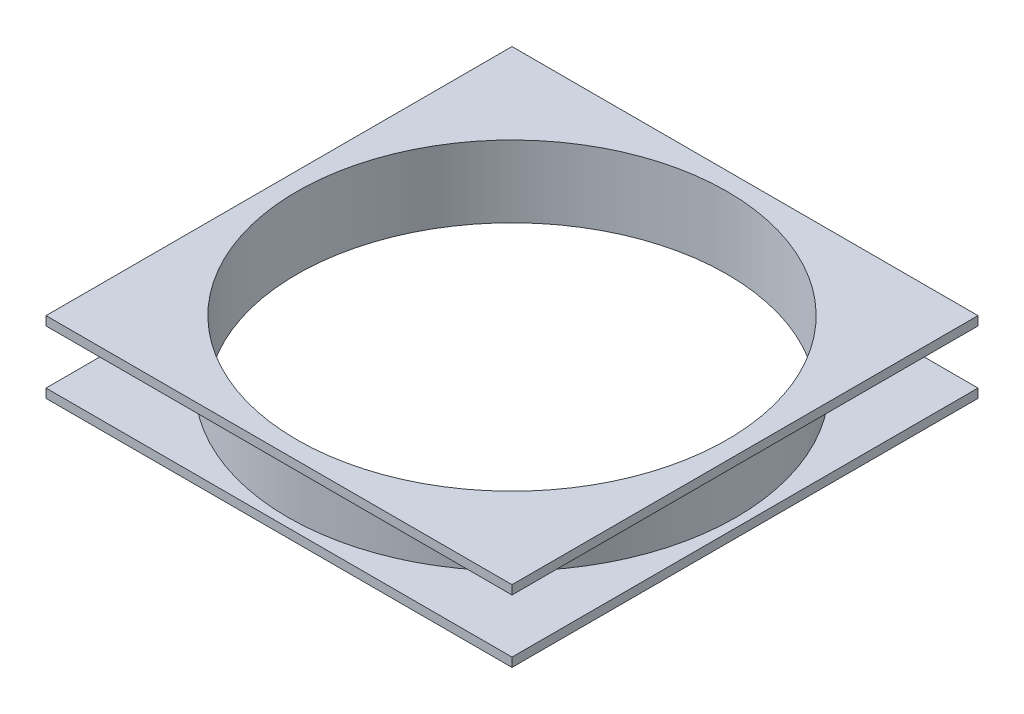
ISO-10303-21;
HEADER;
FILE_DESCRIPTION(('STEP AP214'),'2;1');
FILE_NAME('part.step','',(''),(''),'','','');
FILE_SCHEMA(('AUTOMOTIVE_DESIGN { 1 0 10303 214 1 1 1 1 }'));
ENDSEC;
DATA;
#1=APPLICATION_CONTEXT('core data for automotive mechanical design processes');
#2=APPLICATION_PROTOCOL_DEFINITION('international standard','automotive_design',2000,#1);
#3=PRODUCT_CONTEXT('',#1,'mechanical');
#4=PRODUCT('Part','Part','',(#3));
#5=PRODUCT_RELATED_PRODUCT_CATEGORY('part','',(#4));
#6=PRODUCT_DEFINITION_FORMATION('','',#4);
#7=PRODUCT_DEFINITION_CONTEXT('part definition',#1,'design');
#8=PRODUCT_DEFINITION('design','',#6,#7);
#9=PRODUCT_DEFINITION_SHAPE('','',#8);
#10=(LENGTH_UNIT() NAMED_UNIT(*) SI_UNIT(.MILLI.,.METRE.));
#11=(NAMED_UNIT(*) PLANE_ANGLE_UNIT() SI_UNIT($,.RADIAN.));
#12=(NAMED_UNIT(*) SI_UNIT($,.STERADIAN.) SOLID_ANGLE_UNIT());
#13=UNCERTAINTY_MEASURE_WITH_UNIT(LENGTH_MEASURE(1.E-05),#10,'distance_accuracy_value','');
#14=(GEOMETRIC_REPRESENTATION_CONTEXT(3) GLOBAL_UNCERTAINTY_ASSIGNED_CONTEXT((#13)) GLOBAL_UNIT_ASSIGNED_CONTEXT((#10,
#11,#12)) REPRESENTATION_CONTEXT('',''));
#15=CARTESIAN_POINT('',(0.,0.,0.));
#16=DIRECTION('',(0.,0.,1.));
#17=DIRECTION('',(1.,0.,0.));
#18=AXIS2_PLACEMENT_3D('',#15,#16,#17);
#19=CARTESIAN_POINT('',(0.,7.5,0.));
#20=DIRECTION('',(0.,-1.,0.));
#21=DIRECTION('',(0.,0.,-1.));
#22=AXIS2_PLACEMENT_3D('',#19,#20,#21);
#23=CYLINDRICAL_SURFACE('',#22,62.5);
#24=CARTESIAN_POINT('',(0.,7.5,0.));
#25=DIRECTION('',(0.,1.,0.));
#26=DIRECTION('',(0.,0.,1.));
#27=AXIS2_PLACEMENT_3D('',#24,#25,#26);
#28=CIRCLE('',#27,62.5);
#29=CARTESIAN_POINT('',(0.,7.5,62.5));
#30=VERTEX_POINT('',#29);
#31=EDGE_CURVE('E11',#30,#30,#28,.T.);
#32=ORIENTED_EDGE('',*,*,#31,.F.);
#33=EDGE_LOOP('',(#32));
#34=FACE_BOUND('',#33,.T.);
#35=CARTESIAN_POINT('',(0.,-7.5,0.));
#36=DIRECTION('',(0.,1.,0.));
#37=DIRECTION('',(0.,0.,1.));
#38=AXIS2_PLACEMENT_3D('',#35,#36,#37);
#39=CIRCLE('',#38,62.5);
#40=CARTESIAN_POINT('',(0.,-7.5,62.5));
#41=VERTEX_POINT('',#40);
#42=EDGE_CURVE('E46',#41,#41,#39,.T.);
#43=ORIENTED_EDGE('',*,*,#42,.T.);
#44=EDGE_LOOP('',(#43));
#45=FACE_BOUND('',#44,.T.);
#46=ADVANCED_FACE('F43',(#34,#45),#23,.T.);
#47=CARTESIAN_POINT('',(0.,7.5,0.));
#48=DIRECTION('',(0.,-1.,0.));
#49=DIRECTION('',(0.,0.,-1.));
#50=AXIS2_PLACEMENT_3D('',#47,#48,#49);
#51=CYLINDRICAL_SURFACE('',#50,60.);
#52=CARTESIAN_POINT('',(0.,10.,0.));
#53=DIRECTION('',(0.,1.,0.));
#54=DIRECTION('',(0.,0.,1.));
#55=AXIS2_PLACEMENT_3D('',#52,#53,#54);
#56=CIRCLE('',#55,60.);
#57=CARTESIAN_POINT('',(0.,10.,60.));
#58=VERTEX_POINT('',#57);
#59=EDGE_CURVE('E153',#58,#58,#56,.T.);
#60=ORIENTED_EDGE('',*,*,#59,.T.);
#61=EDGE_LOOP('',(#60));
#62=FACE_BOUND('',#61,.T.);
#63=CARTESIAN_POINT('',(0.,-10.,0.));
#64=DIRECTION('',(0.,-1.,0.));
#65=DIRECTION('',(0.,0.,-1.));
#66=AXIS2_PLACEMENT_3D('',#63,#64,#65);
#67=CIRCLE('',#66,60.);
#68=CARTESIAN_POINT('',(0.,-10.,-60.));
#69=VERTEX_POINT('',#68);
#70=EDGE_CURVE('E230',#69,#69,#67,.T.);
#71=ORIENTED_EDGE('',*,*,#70,.T.);
#72=EDGE_LOOP('',(#71));
#73=FACE_BOUND('',#72,.T.);
#74=ADVANCED_FACE('F209',(#62,#73),#51,.F.);
#75=CARTESIAN_POINT('',(0.,10.,0.));
#76=DIRECTION('',(0.,-1.,0.));
#77=DIRECTION('',(0.,0.,-1.));
#78=AXIS2_PLACEMENT_3D('',#75,#76,#77);
#79=PLANE('',#78);
#80=DIRECTION('',(0.,0.,-1.));
#81=VECTOR('',#80,1.);
#82=CARTESIAN_POINT('',(65.,10.,65.));
#83=LINE('',#82,#81);
#84=CARTESIAN_POINT('',(65.,10.,65.));
#85=VERTEX_POINT('',#84);
#86=CARTESIAN_POINT('',(65.,10.,-65.));
#87=VERTEX_POINT('',#86);
#88=EDGE_CURVE('E162',#85,#87,#83,.T.);
#89=ORIENTED_EDGE('',*,*,#88,.T.);
#90=DIRECTION('',(-1.,0.,0.));
#91=VECTOR('',#90,1.);
#92=CARTESIAN_POINT('',(-65.,10.,-65.));
#93=LINE('',#92,#91);
#94=CARTESIAN_POINT('',(-65.,10.,-65.));
#95=VERTEX_POINT('',#94);
#96=EDGE_CURVE('E93',#87,#95,#93,.T.);
#97=ORIENTED_EDGE('',*,*,#96,.T.);
#98=DIRECTION('',(0.,0.,1.));
#99=VECTOR('',#98,1.);
#100=CARTESIAN_POINT('',(-65.,10.,65.));
#101=LINE('',#100,#99);
#102=CARTESIAN_POINT('',(-65.,10.,65.));
#103=VERTEX_POINT('',#102);
#104=EDGE_CURVE('E167',#95,#103,#101,.T.);
#105=ORIENTED_EDGE('',*,*,#104,.T.);
#106=DIRECTION('',(1.,0.,0.));
#107=VECTOR('',#106,1.);
#108=CARTESIAN_POINT('',(-65.,10.,65.));
#109=LINE('',#108,#107);
#110=EDGE_CURVE('E61',#103,#85,#109,.T.);
#111=ORIENTED_EDGE('',*,*,#110,.T.);
#112=EDGE_LOOP('',(#89,#97,#105,#111));
#113=FACE_BOUND('',#112,.T.);
#114=ORIENTED_EDGE('',*,*,#59,.F.);
#115=EDGE_LOOP('',(#114));
#116=FACE_BOUND('',#115,.T.);
#117=ADVANCED_FACE('F201',(#113,#116),#79,.F.);
#118=CARTESIAN_POINT('',(0.,7.5,0.));
#119=DIRECTION('',(0.,-1.,0.));
#120=DIRECTION('',(0.,0.,-1.));
#121=AXIS2_PLACEMENT_3D('',#118,#119,#120);
#122=PLANE('',#121);
#123=ORIENTED_EDGE('',*,*,#31,.T.);
#124=EDGE_LOOP('',(#123));
#125=FACE_BOUND('',#124,.T.);
#126=DIRECTION('',(0.,0.,-1.));
#127=VECTOR('',#126,1.);
#128=CARTESIAN_POINT('',(65.,7.5,65.));
#129=LINE('',#128,#127);
#130=CARTESIAN_POINT('',(65.,7.5,65.));
#131=VERTEX_POINT('',#130);
#132=CARTESIAN_POINT('',(65.,7.5,-65.));
#133=VERTEX_POINT('',#132);
#134=EDGE_CURVE('E161',#131,#133,#129,.T.);
#135=ORIENTED_EDGE('',*,*,#134,.F.);
#136=DIRECTION('',(1.,0.,0.));
#137=VECTOR('',#136,1.);
#138=CARTESIAN_POINT('',(-65.,7.5,65.));
#139=LINE('',#138,#137);
#140=CARTESIAN_POINT('',(-65.,7.5,65.));
#141=VERTEX_POINT('',#140);
#142=EDGE_CURVE('E85',#141,#131,#139,.T.);
#143=ORIENTED_EDGE('',*,*,#142,.F.);
#144=DIRECTION('',(0.,0.,1.));
#145=VECTOR('',#144,1.);
#146=CARTESIAN_POINT('',(-65.,7.5,65.));
#147=LINE('',#146,#145);
#148=CARTESIAN_POINT('',(-65.,7.5,-65.));
#149=VERTEX_POINT('',#148);
#150=EDGE_CURVE('E79',#149,#141,#147,.T.);
#151=ORIENTED_EDGE('',*,*,#150,.F.);
#152=DIRECTION('',(-1.,0.,0.));
#153=VECTOR('',#152,1.);
#154=CARTESIAN_POINT('',(-65.,7.5,-65.));
#155=LINE('',#154,#153);
#156=EDGE_CURVE('E176',#133,#149,#155,.T.);
#157=ORIENTED_EDGE('',*,*,#156,.F.);
#158=EDGE_LOOP('',(#135,#143,#151,#157));
#159=FACE_BOUND('',#158,.T.);
#160=ADVANCED_FACE('F199',(#125,#159),#122,.T.);
#161=CARTESIAN_POINT('',(65.,10.,65.));
#162=DIRECTION('',(-1.,0.,0.));
#163=DIRECTION('',(0.,0.,1.));
#164=AXIS2_PLACEMENT_3D('',#161,#162,#163);
#165=PLANE('',#164);
#166=ORIENTED_EDGE('',*,*,#134,.T.);
#167=DIRECTION('',(0.,-1.,0.));
#168=VECTOR('',#167,1.);
#169=CARTESIAN_POINT('',(65.,10.,-65.));
#170=LINE('',#169,#168);
#171=EDGE_CURVE('E53',#87,#133,#170,.T.);
#172=ORIENTED_EDGE('',*,*,#171,.F.);
#173=ORIENTED_EDGE('',*,*,#88,.F.);
#174=DIRECTION('',(0.,-1.,0.));
#175=VECTOR('',#174,1.);
#176=CARTESIAN_POINT('',(65.,10.,65.));
#177=LINE('',#176,#175);
#178=EDGE_CURVE('E172',#85,#131,#177,.T.);
#179=ORIENTED_EDGE('',*,*,#178,.T.);
#180=EDGE_LOOP('',(#166,#172,#173,#179));
#181=FACE_BOUND('',#180,.T.);
#182=ADVANCED_FACE('F197',(#181),#165,.F.);
#183=CARTESIAN_POINT('',(-65.,10.,-65.));
#184=DIRECTION('',(0.,0.,1.));
#185=DIRECTION('',(1.,0.,0.));
#186=AXIS2_PLACEMENT_3D('',#183,#184,#185);
#187=PLANE('',#186);
#188=ORIENTED_EDGE('',*,*,#156,.T.);
#189=DIRECTION('',(0.,-1.,0.));
#190=VECTOR('',#189,1.);
#191=CARTESIAN_POINT('',(-65.,10.,-65.));
#192=LINE('',#191,#190);
#193=EDGE_CURVE('E188',#95,#149,#192,.T.);
#194=ORIENTED_EDGE('',*,*,#193,.F.);
#195=ORIENTED_EDGE('',*,*,#96,.F.);
#196=ORIENTED_EDGE('',*,*,#171,.T.);
#197=EDGE_LOOP('',(#188,#194,#195,#196));
#198=FACE_BOUND('',#197,.T.);
#199=ADVANCED_FACE('F193',(#198),#187,.F.);
#200=CARTESIAN_POINT('',(-65.,10.,65.));
#201=DIRECTION('',(1.,0.,0.));
#202=DIRECTION('',(0.,0.,-1.));
#203=AXIS2_PLACEMENT_3D('',#200,#201,#202);
#204=PLANE('',#203);
#205=ORIENTED_EDGE('',*,*,#150,.T.);
#206=DIRECTION('',(0.,-1.,0.));
#207=VECTOR('',#206,1.);
#208=CARTESIAN_POINT('',(-65.,10.,65.));
#209=LINE('',#208,#207);
#210=EDGE_CURVE('E185',#103,#141,#209,.T.);
#211=ORIENTED_EDGE('',*,*,#210,.F.);
#212=ORIENTED_EDGE('',*,*,#104,.F.);
#213=ORIENTED_EDGE('',*,*,#193,.T.);
#214=EDGE_LOOP('',(#205,#211,#212,#213));
#215=FACE_BOUND('',#214,.T.);
#216=ADVANCED_FACE('F318',(#215),#204,.F.);
#217=CARTESIAN_POINT('',(-65.,10.,65.));
#218=DIRECTION('',(0.,0.,-1.));
#219=DIRECTION('',(-1.,0.,0.));
#220=AXIS2_PLACEMENT_3D('',#217,#218,#219);
#221=PLANE('',#220);
#222=ORIENTED_EDGE('',*,*,#142,.T.);
#223=ORIENTED_EDGE('',*,*,#178,.F.);
#224=ORIENTED_EDGE('',*,*,#110,.F.);
#225=ORIENTED_EDGE('',*,*,#210,.T.);
#226=EDGE_LOOP('',(#222,#223,#224,#225));
#227=FACE_BOUND('',#226,.T.);
#228=ADVANCED_FACE('F308',(#227),#221,.F.);
#229=CARTESIAN_POINT('',(0.,-10.,0.));
#230=DIRECTION('',(0.,1.,0.));
#231=DIRECTION('',(0.,0.,1.));
#232=AXIS2_PLACEMENT_3D('',#229,#230,#231);
#233=PLANE('',#232);
#234=DIRECTION('',(0.,0.,1.));
#235=VECTOR('',#234,1.);
#236=CARTESIAN_POINT('',(65.,-10.,-65.));
#237=LINE('',#236,#235);
#238=CARTESIAN_POINT('',(65.,-10.,-65.));
#239=VERTEX_POINT('',#238);
#240=CARTESIAN_POINT('',(65.,-10.,65.));
#241=VERTEX_POINT('',#240);
#242=EDGE_CURVE('E132',#239,#241,#237,.T.);
#243=ORIENTED_EDGE('',*,*,#242,.T.);
#244=DIRECTION('',(-1.,0.,0.));
#245=VECTOR('',#244,1.);
#246=CARTESIAN_POINT('',(-65.,-10.,65.));
#247=LINE('',#246,#245);
#248=CARTESIAN_POINT('',(-65.,-10.,65.));
#249=VERTEX_POINT('',#248);
#250=EDGE_CURVE('E120',#241,#249,#247,.T.);
#251=ORIENTED_EDGE('',*,*,#250,.T.);
#252=DIRECTION('',(0.,0.,-1.));
#253=VECTOR('',#252,1.);
#254=CARTESIAN_POINT('',(-65.,-10.,-65.));
#255=LINE('',#254,#253);
#256=CARTESIAN_POINT('',(-65.,-10.,-65.));
#257=VERTEX_POINT('',#256);
#258=EDGE_CURVE('E131',#249,#257,#255,.T.);
#259=ORIENTED_EDGE('',*,*,#258,.T.);
#260=DIRECTION('',(1.,0.,0.));
#261=VECTOR('',#260,1.);
#262=CARTESIAN_POINT('',(-65.,-10.,-65.));
#263=LINE('',#262,#261);
#264=EDGE_CURVE('E138',#257,#239,#263,.T.);
#265=ORIENTED_EDGE('',*,*,#264,.T.);
#266=EDGE_LOOP('',(#243,#251,#259,#265));
#267=FACE_BOUND('',#266,.T.);
#268=ORIENTED_EDGE('',*,*,#70,.F.);
#269=EDGE_LOOP('',(#268));
#270=FACE_BOUND('',#269,.T.);
#271=ADVANCED_FACE('F135',(#267,#270),#233,.F.);
#272=CARTESIAN_POINT('',(0.,-7.5,0.));
#273=DIRECTION('',(0.,1.,0.));
#274=DIRECTION('',(0.,0.,1.));
#275=AXIS2_PLACEMENT_3D('',#272,#273,#274);
#276=PLANE('',#275);
#277=ORIENTED_EDGE('',*,*,#42,.F.);
#278=EDGE_LOOP('',(#277));
#279=FACE_BOUND('',#278,.T.);
#280=DIRECTION('',(0.,0.,1.));
#281=VECTOR('',#280,1.);
#282=CARTESIAN_POINT('',(65.,-7.5,-65.));
#283=LINE('',#282,#281);
#284=CARTESIAN_POINT('',(65.,-7.5,-65.));
#285=VERTEX_POINT('',#284);
#286=CARTESIAN_POINT('',(65.,-7.5,65.));
#287=VERTEX_POINT('',#286);
#288=EDGE_CURVE('E147',#285,#287,#283,.T.);
#289=ORIENTED_EDGE('',*,*,#288,.F.);
#290=DIRECTION('',(1.,0.,0.));
#291=VECTOR('',#290,1.);
#292=CARTESIAN_POINT('',(-65.,-7.5,-65.));
#293=LINE('',#292,#291);
#294=CARTESIAN_POINT('',(-65.,-7.5,-65.));
#295=VERTEX_POINT('',#294);
#296=EDGE_CURVE('E143',#295,#285,#293,.T.);
#297=ORIENTED_EDGE('',*,*,#296,.F.);
#298=DIRECTION('',(0.,0.,-1.));
#299=VECTOR('',#298,1.);
#300=CARTESIAN_POINT('',(-65.,-7.5,-65.));
#301=LINE('',#300,#299);
#302=CARTESIAN_POINT('',(-65.,-7.5,65.));
#303=VERTEX_POINT('',#302);
#304=EDGE_CURVE('E234',#303,#295,#301,.T.);
#305=ORIENTED_EDGE('',*,*,#304,.F.);
#306=DIRECTION('',(-1.,0.,0.));
#307=VECTOR('',#306,1.);
#308=CARTESIAN_POINT('',(-65.,-7.5,65.));
#309=LINE('',#308,#307);
#310=EDGE_CURVE('E228',#287,#303,#309,.T.);
#311=ORIENTED_EDGE('',*,*,#310,.F.);
#312=EDGE_LOOP('',(#289,#297,#305,#311));
#313=FACE_BOUND('',#312,.T.);
#314=ADVANCED_FACE('F222',(#279,#313),#276,.T.);
#315=CARTESIAN_POINT('',(65.,-10.,-65.));
#316=DIRECTION('',(-1.,0.,0.));
#317=DIRECTION('',(0.,0.,1.));
#318=AXIS2_PLACEMENT_3D('',#315,#316,#317);
#319=PLANE('',#318);
#320=ORIENTED_EDGE('',*,*,#288,.T.);
#321=DIRECTION('',(0.,1.,0.));
#322=VECTOR('',#321,1.);
#323=CARTESIAN_POINT('',(65.,-10.,65.));
#324=LINE('',#323,#322);
#325=EDGE_CURVE('E124',#241,#287,#324,.T.);
#326=ORIENTED_EDGE('',*,*,#325,.F.);
#327=ORIENTED_EDGE('',*,*,#242,.F.);
#328=DIRECTION('',(0.,1.,0.));
#329=VECTOR('',#328,1.);
#330=CARTESIAN_POINT('',(65.,-10.,-65.));
#331=LINE('',#330,#329);
#332=EDGE_CURVE('E245',#239,#285,#331,.T.);
#333=ORIENTED_EDGE('',*,*,#332,.T.);
#334=EDGE_LOOP('',(#320,#326,#327,#333));
#335=FACE_BOUND('',#334,.T.);
#336=ADVANCED_FACE('F145',(#335),#319,.F.);
#337=CARTESIAN_POINT('',(-65.,-10.,65.));
#338=DIRECTION('',(0.,0.,-1.));
#339=DIRECTION('',(-1.,0.,0.));
#340=AXIS2_PLACEMENT_3D('',#337,#338,#339);
#341=PLANE('',#340);
#342=ORIENTED_EDGE('',*,*,#310,.T.);
#343=DIRECTION('',(0.,1.,0.));
#344=VECTOR('',#343,1.);
#345=CARTESIAN_POINT('',(-65.,-10.,65.));
#346=LINE('',#345,#344);
#347=EDGE_CURVE('E127',#249,#303,#346,.T.);
#348=ORIENTED_EDGE('',*,*,#347,.F.);
#349=ORIENTED_EDGE('',*,*,#250,.F.);
#350=ORIENTED_EDGE('',*,*,#325,.T.);
#351=EDGE_LOOP('',(#342,#348,#349,#350));
#352=FACE_BOUND('',#351,.T.);
#353=ADVANCED_FACE('F122',(#352),#341,.F.);
#354=CARTESIAN_POINT('',(-65.,-10.,-65.));
#355=DIRECTION('',(1.,0.,0.));
#356=DIRECTION('',(0.,0.,-1.));
#357=AXIS2_PLACEMENT_3D('',#354,#355,#356);
#358=PLANE('',#357);
#359=ORIENTED_EDGE('',*,*,#304,.T.);
#360=DIRECTION('',(0.,1.,0.));
#361=VECTOR('',#360,1.);
#362=CARTESIAN_POINT('',(-65.,-10.,-65.));
#363=LINE('',#362,#361);
#364=EDGE_CURVE('E154',#257,#295,#363,.T.);
#365=ORIENTED_EDGE('',*,*,#364,.F.);
#366=ORIENTED_EDGE('',*,*,#258,.F.);
#367=ORIENTED_EDGE('',*,*,#347,.T.);
#368=EDGE_LOOP('',(#359,#365,#366,#367));
#369=FACE_BOUND('',#368,.T.);
#370=ADVANCED_FACE('F253',(#369),#358,.F.);
#371=CARTESIAN_POINT('',(-65.,-10.,-65.));
#372=DIRECTION('',(0.,0.,1.));
#373=DIRECTION('',(1.,0.,0.));
#374=AXIS2_PLACEMENT_3D('',#371,#372,#373);
#375=PLANE('',#374);
#376=ORIENTED_EDGE('',*,*,#296,.T.);
#377=ORIENTED_EDGE('',*,*,#332,.F.);
#378=ORIENTED_EDGE('',*,*,#264,.F.);
#379=ORIENTED_EDGE('',*,*,#364,.T.);
#380=EDGE_LOOP('',(#376,#377,#378,#379));
#381=FACE_BOUND('',#380,.T.);
#382=ADVANCED_FACE('F251',(#381),#375,.F.);
#383=CLOSED_SHELL('',(#46,#74,#117,#160,#182,#199,#216,#228,#271,#314,#336,#353,#370,#382));
#384=MANIFOLD_SOLID_BREP('B2',#383);
#385=ADVANCED_BREP_SHAPE_REPRESENTATION('',(#18,#384),#14);
#386=SHAPE_DEFINITION_REPRESENTATION(#9,#385);
ENDSEC;
END-ISO-10303-21;
